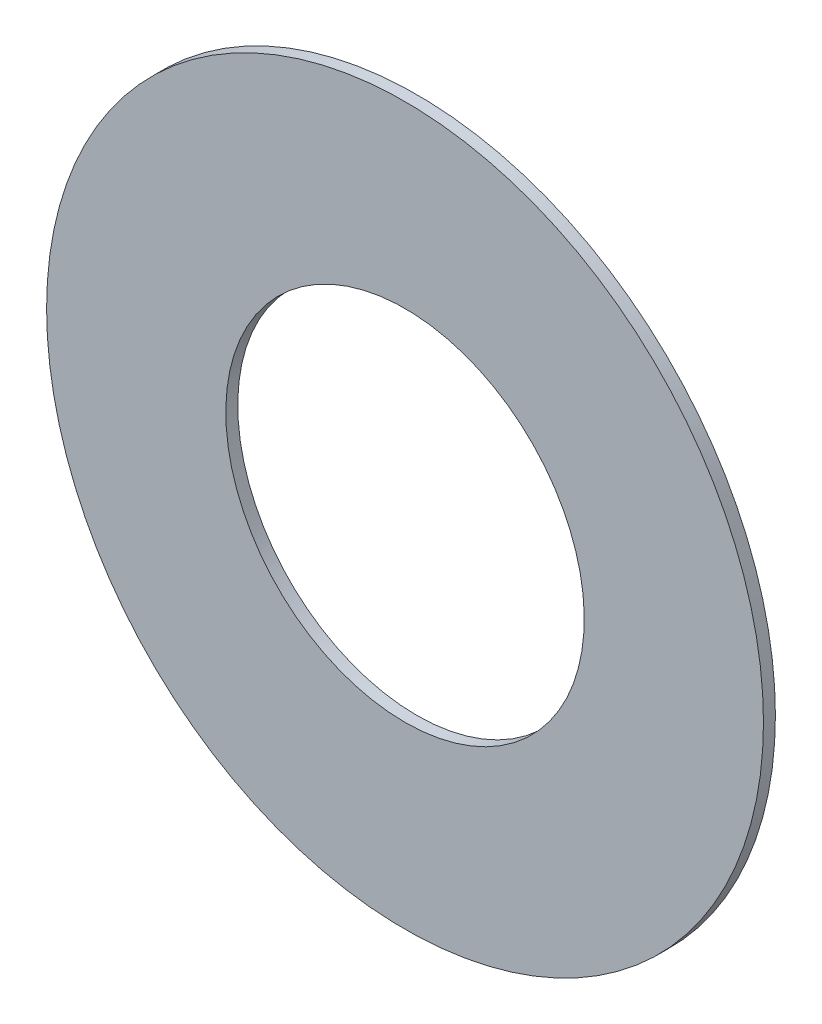
ISO-10303-21;
HEADER;
FILE_DESCRIPTION(('STEP AP214'),'2;1');
FILE_NAME('part.step','',(''),(''),'','','');
FILE_SCHEMA(('AUTOMOTIVE_DESIGN { 1 0 10303 214 1 1 1 1 }'));
ENDSEC;
DATA;
#1=APPLICATION_CONTEXT('core data for automotive mechanical design processes');
#2=APPLICATION_PROTOCOL_DEFINITION('international standard','automotive_design',2000,#1);
#3=PRODUCT_CONTEXT('',#1,'mechanical');
#4=PRODUCT('Part','Part','',(#3));
#5=PRODUCT_RELATED_PRODUCT_CATEGORY('part','',(#4));
#6=PRODUCT_DEFINITION_FORMATION('','',#4);
#7=PRODUCT_DEFINITION_CONTEXT('part definition',#1,'design');
#8=PRODUCT_DEFINITION('design','',#6,#7);
#9=PRODUCT_DEFINITION_SHAPE('','',#8);
#10=(LENGTH_UNIT() NAMED_UNIT(*) SI_UNIT(.MILLI.,.METRE.));
#11=(NAMED_UNIT(*) PLANE_ANGLE_UNIT() SI_UNIT($,.RADIAN.));
#12=(NAMED_UNIT(*) SI_UNIT($,.STERADIAN.) SOLID_ANGLE_UNIT());
#13=UNCERTAINTY_MEASURE_WITH_UNIT(LENGTH_MEASURE(1.E-05),#10,'distance_accuracy_value','');
#14=(GEOMETRIC_REPRESENTATION_CONTEXT(3) GLOBAL_UNCERTAINTY_ASSIGNED_CONTEXT((#13)) GLOBAL_UNIT_ASSIGNED_CONTEXT((#10,
#11,#12)) REPRESENTATION_CONTEXT('',''));
#15=CARTESIAN_POINT('',(0.,0.,0.));
#16=DIRECTION('',(0.,0.,1.));
#17=DIRECTION('',(1.,0.,0.));
#18=AXIS2_PLACEMENT_3D('',#15,#16,#17);
#19=CARTESIAN_POINT('',(129.352,-111.684,-0.045));
#20=DIRECTION('',(0.,0.,-1.));
#21=DIRECTION('',(0.,-1.,0.));
#22=AXIS2_PLACEMENT_3D('',#19,#20,#21);
#23=CYLINDRICAL_SURFACE('',#22,0.525);
#24=CARTESIAN_POINT('',(129.352,-111.684,1.67));
#25=DIRECTION('',(0.,0.,-1.));
#26=DIRECTION('',(0.,-1.,0.));
#27=AXIS2_PLACEMENT_3D('',#24,#25,#26);
#28=CIRCLE('',#27,0.525);
#29=CARTESIAN_POINT('',(129.352,-112.209,1.67));
#30=VERTEX_POINT('',#29);
#31=EDGE_CURVE('E20',#30,#30,#28,.T.);
#32=ORIENTED_EDGE('',*,*,#31,.T.);
#33=DIRECTION('',(0.,0.,1.));
#34=VECTOR('',#33,1.);
#35=CARTESIAN_POINT('',(129.352,-112.209,-0.045));
#36=LINE('',#35,#34);
#37=CARTESIAN_POINT('',(129.352,-112.209,1.705));
#38=VERTEX_POINT('',#37);
#39=EDGE_CURVE('E11',#30,#38,#36,.T.);
#40=ORIENTED_EDGE('',*,*,#39,.T.);
#41=CARTESIAN_POINT('',(129.352,-111.684,1.705));
#42=DIRECTION('',(0.,0.,-1.));
#43=DIRECTION('',(0.,-1.,0.));
#44=AXIS2_PLACEMENT_3D('',#41,#42,#43);
#45=CIRCLE('',#44,0.525);
#46=EDGE_CURVE('E68',#38,#38,#45,.T.);
#47=ORIENTED_EDGE('',*,*,#46,.F.);
#48=ORIENTED_EDGE('',*,*,#39,.F.);
#49=EDGE_LOOP('',(#32,#40,#47,#48));
#50=FACE_BOUND('',#49,.T.);
#51=ADVANCED_FACE('F17',(#50),#23,.F.);
#52=CARTESIAN_POINT('',(129.352,-111.684,1.67));
#53=DIRECTION('',(0.,0.,1.));
#54=DIRECTION('',(1.,0.,0.));
#55=AXIS2_PLACEMENT_3D('',#52,#53,#54);
#56=PLANE('',#55);
#57=ORIENTED_EDGE('',*,*,#31,.F.);
#58=EDGE_LOOP('',(#57));
#59=FACE_BOUND('',#58,.T.);
#60=CARTESIAN_POINT('',(129.352,-111.684,1.67));
#61=DIRECTION('',(0.,0.,1.));
#62=DIRECTION('',(1.,0.,0.));
#63=AXIS2_PLACEMENT_3D('',#60,#61,#62);
#64=CIRCLE('',#63,1.05);
#65=CARTESIAN_POINT('',(130.402,-111.684,1.67));
#66=VERTEX_POINT('',#65);
#67=EDGE_CURVE('E56',#66,#66,#64,.T.);
#68=ORIENTED_EDGE('',*,*,#67,.F.);
#69=EDGE_LOOP('',(#68));
#70=FACE_BOUND('',#69,.T.);
#71=ADVANCED_FACE('F78',(#59,#70),#56,.F.);
#72=CARTESIAN_POINT('',(129.352,-111.684,1.705));
#73=DIRECTION('',(0.,0.,1.));
#74=DIRECTION('',(1.,0.,0.));
#75=AXIS2_PLACEMENT_3D('',#72,#73,#74);
#76=PLANE('',#75);
#77=ORIENTED_EDGE('',*,*,#46,.T.);
#78=EDGE_LOOP('',(#77));
#79=FACE_BOUND('',#78,.T.);
#80=CARTESIAN_POINT('',(129.352,-111.684,1.705));
#81=DIRECTION('',(0.,0.,1.));
#82=DIRECTION('',(1.,0.,0.));
#83=AXIS2_PLACEMENT_3D('',#80,#81,#82);
#84=CIRCLE('',#83,1.05);
#85=CARTESIAN_POINT('',(130.402,-111.684,1.705));
#86=VERTEX_POINT('',#85);
#87=EDGE_CURVE('E54',#86,#86,#84,.T.);
#88=ORIENTED_EDGE('',*,*,#87,.T.);
#89=EDGE_LOOP('',(#88));
#90=FACE_BOUND('',#89,.T.);
#91=ADVANCED_FACE('F60',(#79,#90),#76,.T.);
#92=CARTESIAN_POINT('',(129.352,-111.684,1.67));
#93=DIRECTION('',(0.,0.,1.));
#94=DIRECTION('',(1.,0.,0.));
#95=AXIS2_PLACEMENT_3D('',#92,#93,#94);
#96=CYLINDRICAL_SURFACE('',#95,1.05);
#97=ORIENTED_EDGE('',*,*,#87,.F.);
#98=DIRECTION('',(0.,0.,1.));
#99=VECTOR('',#98,1.);
#100=CARTESIAN_POINT('',(130.402,-111.684,1.67));
#101=LINE('',#100,#99);
#102=EDGE_CURVE('E51',#66,#86,#101,.T.);
#103=ORIENTED_EDGE('',*,*,#102,.F.);
#104=ORIENTED_EDGE('',*,*,#67,.T.);
#105=ORIENTED_EDGE('',*,*,#102,.T.);
#106=EDGE_LOOP('',(#97,#103,#104,#105));
#107=FACE_BOUND('',#106,.T.);
#108=ADVANCED_FACE('F53',(#107),#96,.T.);
#109=CLOSED_SHELL('',(#51,#71,#91,#108));
#110=MANIFOLD_SOLID_BREP('B1',#109);
#111=ADVANCED_BREP_SHAPE_REPRESENTATION('',(#18,#110),#14);
#112=SHAPE_DEFINITION_REPRESENTATION(#9,#111);
ENDSEC;
END-ISO-10303-21;
